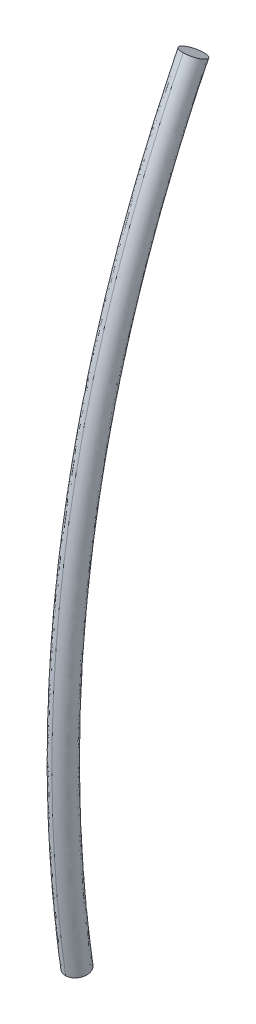
ISO-10303-21;
HEADER;
FILE_DESCRIPTION(('STEP AP214'),'2;1');
FILE_NAME('part.step','',(''),(''),'','','');
FILE_SCHEMA(('AUTOMOTIVE_DESIGN { 1 0 10303 214 1 1 1 1 }'));
ENDSEC;
DATA;
#1=APPLICATION_CONTEXT('core data for automotive mechanical design processes');
#2=APPLICATION_PROTOCOL_DEFINITION('international standard','automotive_design',2000,#1);
#3=PRODUCT_CONTEXT('',#1,'mechanical');
#4=PRODUCT('Part','Part','',(#3));
#5=PRODUCT_RELATED_PRODUCT_CATEGORY('part','',(#4));
#6=PRODUCT_DEFINITION_FORMATION('','',#4);
#7=PRODUCT_DEFINITION_CONTEXT('part definition',#1,'design');
#8=PRODUCT_DEFINITION('design','',#6,#7);
#9=PRODUCT_DEFINITION_SHAPE('','',#8);
#10=(LENGTH_UNIT() NAMED_UNIT(*) SI_UNIT(.MILLI.,.METRE.));
#11=(NAMED_UNIT(*) PLANE_ANGLE_UNIT() SI_UNIT($,.RADIAN.));
#12=(NAMED_UNIT(*) SI_UNIT($,.STERADIAN.) SOLID_ANGLE_UNIT());
#13=UNCERTAINTY_MEASURE_WITH_UNIT(LENGTH_MEASURE(1.E-05),#10,'distance_accuracy_value','');
#14=(GEOMETRIC_REPRESENTATION_CONTEXT(3) GLOBAL_UNCERTAINTY_ASSIGNED_CONTEXT((#13)) GLOBAL_UNIT_ASSIGNED_CONTEXT((#10,
#11,#12)) REPRESENTATION_CONTEXT('',''));
#15=CARTESIAN_POINT('',(0.,0.,0.));
#16=DIRECTION('',(0.,0.,1.));
#17=DIRECTION('',(1.,0.,0.));
#18=AXIS2_PLACEMENT_3D('',#15,#16,#17);
#19=CARTESIAN_POINT('',(-71.89158931535,31.2153070087,3.940002599999));
#20=DIRECTION('',(-4.4741601511132E-05,0.897114853412041,-0.44179739449852));
#21=DIRECTION('',(0.,0.441797394940718,0.897114854309968));
#22=AXIS2_PLACEMENT_3D('',#19,#20,#21);
#23=PLANE('',#22);
#24=CARTESIAN_POINT('',(-71.8915947739043,31.3257563571897,4.16428131363081));
#25=CARTESIAN_POINT('',(-71.9056589757299,31.3257609339028,4.16429203142194));
#26=CARTESIAN_POINT('',(-71.9197195857157,31.3252309427078,4.16321725396753));
#27=CARTESIAN_POINT('',(-71.9474330067474,31.3231407286132,4.1589756667796));
#28=CARTESIAN_POINT('',(-71.9610861086174,31.3215812597258,4.15581038817432));
#29=CARTESIAN_POINT('',(-71.9876117754916,31.3174699347401,4.14746460805658));
#30=CARTESIAN_POINT('',(-72.0004839751534,31.3149176182177,4.14228317156877));
#31=CARTESIAN_POINT('',(-72.0250736602609,31.3088953436464,4.13005681655938));
#32=CARTESIAN_POINT('',(-72.0367913719401,31.3054255658761,4.12301226413485));
#33=CARTESIAN_POINT('',(-72.0587355765952,31.2976685365329,4.10726304399484));
#34=CARTESIAN_POINT('',(-72.0689629638012,31.2933817787611,4.09855937908353));
#35=CARTESIAN_POINT('',(-72.0876582430892,31.2841045136755,4.07972283555885));
#36=CARTESIAN_POINT('',(-72.0961236477839,31.2791130279483,4.0695879699248));
#37=CARTESIAN_POINT('',(-72.1110258597953,31.2685800320856,4.04820115232887));
#38=CARTESIAN_POINT('',(-72.117465436727,31.2630392866302,4.03695075340858));
#39=CARTESIAN_POINT('',(-72.1281565340706,31.2515513203482,4.01362434411198));
#40=CARTESIAN_POINT('',(-72.132405093591,31.2456035617161,4.00154724136642));
#41=CARTESIAN_POINT('',(-72.1385781047119,31.2334814427592,3.97693266256617));
#42=CARTESIAN_POINT('',(-72.1405041185879,31.227307237639,3.96439550182825));
#43=CARTESIAN_POINT('',(-72.1419826178761,31.2149036999018,3.93920899795336));
#44=CARTESIAN_POINT('',(-72.1415351032342,31.2086743672836,3.92655965481384));
#45=CARTESIAN_POINT('',(-72.1382781082662,31.1963332277285,3.90149937726594));
#46=CARTESIAN_POINT('',(-72.1354670378366,31.1902215027453,3.88908860911196));
#47=CARTESIAN_POINT('',(-72.1275661397024,31.1783017204247,3.86488347028292));
#48=CARTESIAN_POINT('',(-72.1224793836466,31.172493265505,3.85308829258771));
#49=CARTESIAN_POINT('',(-72.1101635995681,31.1613281078515,3.83041504932206));
#50=CARTESIAN_POINT('',(-72.1029316392906,31.1559720364339,3.8195382654071));
#51=CARTESIAN_POINT('',(-72.086545177275,31.1458799808566,3.79904365355758));
#52=CARTESIAN_POINT('',(-72.0773933754947,31.1411431408714,3.78942408805493));
#53=CARTESIAN_POINT('',(-72.0574065334431,31.1324088333038,3.77168615796746));
#54=CARTESIAN_POINT('',(-72.0465691511143,31.1284124116986,3.76356991710902));
#55=CARTESIAN_POINT('',(-72.0235445301244,31.121285908719,3.74909649124935));
#56=CARTESIAN_POINT('',(-72.0113592069575,31.1181546195417,3.74273685387444));
#57=CARTESIAN_POINT('',(-71.9859543127793,31.1128354898313,3.73193324347405));
#58=CARTESIAN_POINT('',(-71.9727332478407,31.1106490428522,3.72749210005122));
#59=CARTESIAN_POINT('',(-71.945664138241,31.1072920798072,3.72067270146984));
#60=CARTESIAN_POINT('',(-71.931817085394,31.1061200120872,3.71829129561906));
#61=CARTESIAN_POINT('',(-71.9091255918094,31.1050601478743,3.71613683478779));
#62=CARTESIAN_POINT('',(-71.9003523890214,31.1048555735249,3.71572053714348));
#63=CARTESIAN_POINT('',(-71.8915838069301,31.1048576602118,3.71572388636519));
#64=B_SPLINE_CURVE_WITH_KNOTS('',3,(#24,#25,#26,#27,#28,#29,#30,#31,#32,#33,#34,#35,#36,#37,#38,
#39,#40,#41,#42,#43,#44,#45,#46,#47,#48,#49,#50,#51,#52,#53,#54,#55,#56,#57,#58,#59,#60,#61,#62,
#63),.UNSPECIFIED.,.F.,.F.,(4,2,2,2,2,2,2,2,2,2,2,2,2,2,2,2,2,2,2,4),(0.,0.0421365633234534,
0.084242299090836,0.126367584335775,0.16848459822216,0.210576235913576,0.252726897197846,
0.294819679125122,0.336969196202027,0.379090345285913,0.421211495328252,0.463361005447066,
0.505453794331361,0.54760438659307,0.589696093316827,0.631846816316597,0.673938392277649,
0.716091839232635,0.758180691249825,0.784486413896929),.UNSPECIFIED.);
#65=CARTESIAN_POINT('',(-71.8915947739043,31.3257563571915,4.1642813136308));
#66=VERTEX_POINT('',#65);
#67=CARTESIAN_POINT('',(-71.89158380693,31.1048576602107,3.71572388636629));
#68=VERTEX_POINT('',#67);
#69=EDGE_CURVE('E54',#66,#68,#64,.T.);
#70=ORIENTED_EDGE('',*,*,#69,.F.);
#71=CARTESIAN_POINT('',(-71.89158380693,31.1048576602122,3.71572388636605));
#72=CARTESIAN_POINT('',(-71.877519605102,31.1048530847383,3.71571317109116));
#73=CARTESIAN_POINT('',(-71.8634589953552,31.1053830771722,3.71678795106115));
#74=CARTESIAN_POINT('',(-71.8357455752664,31.1074732937084,3.72102954320731));
#75=CARTESIAN_POINT('',(-71.8220924741001,31.1090327637987,3.72419482425527));
#76=CARTESIAN_POINT('',(-71.7955668090811,31.1131440911214,3.73254060911876));
#77=CARTESIAN_POINT('',(-71.7826946105712,31.115696408778,3.73772204790957));
#78=CARTESIAN_POINT('',(-71.7581049281817,31.1217186855157,3.74994840731841));
#79=CARTESIAN_POINT('',(-71.7463872180685,31.1251884643183,3.75699296183941));
#80=CARTESIAN_POINT('',(-71.7244430169144,31.1329454955948,3.77274218590556));
#81=CARTESIAN_POINT('',(-71.7142156316434,31.1372322542677,3.78144585264667));
#82=CARTESIAN_POINT('',(-71.6955203565429,31.1465095210002,3.80028239951619));
#83=CARTESIAN_POINT('',(-71.6870549541013,31.1515010074732,3.81041726666482));
#84=CARTESIAN_POINT('',(-71.6721527468443,31.1620340046487,3.83180408692696));
#85=CARTESIAN_POINT('',(-71.6657131724136,31.1675747506713,3.84305448699936));
#86=CARTESIAN_POINT('',(-71.6550220802557,31.179062717895,3.86638089820871));
#87=CARTESIAN_POINT('',(-71.65077352342,31.1850104769014,3.87845800171437));
#88=CARTESIAN_POINT('',(-71.6446005177711,31.1971325964019,3.90307258161903));
#89=CARTESIAN_POINT('',(-71.6426745066821,31.2033068016916,3.91560974270155));
#90=CARTESIAN_POINT('',(-71.641196012993,31.2157103395588,3.94079624684095));
#91=CARTESIAN_POINT('',(-71.6416435304468,31.2219396721375,3.9534455899004));
#92=CARTESIAN_POINT('',(-71.6449005309859,31.2342808114052,3.97850586686529));
#93=CARTESIAN_POINT('',(-71.6477116041744,31.2403925361404,3.99091663451606));
#94=CARTESIAN_POINT('',(-71.6556125076896,31.2523123177643,4.01512177193096));
#95=CARTESIAN_POINT('',(-71.6606992663674,31.2581207722355,4.02691694871579));
#96=CARTESIAN_POINT('',(-71.673015055486,31.2692859288035,4.04959018977752));
#97=CARTESIAN_POINT('',(-71.6802470181813,31.2746419995837,4.06046697239843));
#98=CARTESIAN_POINT('',(-71.6966334847525,31.2847340537168,4.08096158131587));
#99=CARTESIAN_POINT('',(-71.705785288671,31.2894708928955,4.09058114518101));
#100=CARTESIAN_POINT('',(-71.7257721346659,31.2982051987024,4.10831907169361));
#101=CARTESIAN_POINT('',(-71.7366095187996,31.3022016193531,4.11643531061405));
#102=CARTESIAN_POINT('',(-71.7596341430088,31.3093281203044,4.13090873235538));
#103=CARTESIAN_POINT('',(-71.7718194675904,31.3124594084082,4.13726836755054));
#104=CARTESIAN_POINT('',(-71.7972243641927,31.3177785358854,4.14807197341646));
#105=CARTESIAN_POINT('',(-71.8104454301422,31.3199649817026,4.15251311448003));
#106=CARTESIAN_POINT('',(-71.8375145412784,31.3233219423608,4.15933250821503));
#107=CARTESIAN_POINT('',(-71.8513615946489,31.3244940088603,4.16171391158756));
#108=CARTESIAN_POINT('',(-71.8740530555945,31.3255538695226,4.16386836520545));
#109=CARTESIAN_POINT('',(-71.8828262250505,31.3257584430877,4.16428466125395));
#110=CARTESIAN_POINT('',(-71.8915947739041,31.3257563571901,4.16428131363168));
#111=B_SPLINE_CURVE_WITH_KNOTS('',3,(#71,#72,#73,#74,#75,#76,#77,#78,#79,#80,#81,#82,#83,#84,
#85,#86,#87,#88,#89,#90,#91,#92,#93,#94,#95,#96,#97,#98,#99,#100,#101,#102,#103,#104,#105,#106,
#107,#108,#109,#110),.UNSPECIFIED.,.F.,.F.,(4,2,2,2,2,2,2,2,2,2,2,2,2,2,2,2,2,2,2,4),(0.,
0.0421365633235624,0.0842422990910518,0.126367584336161,0.168484598222691,0.210576235914035,
0.252726897198208,0.29481967912527,0.336969196201963,0.379090345285659,0.421211495327791,
0.46336100544553,0.505453794328785,0.547604386589673,0.589696093312304,0.631846816316767,
0.673938392276203,0.716091839322575,0.758180691252607,0.784486314318599),.UNSPECIFIED.);
#112=EDGE_CURVE('E49',#68,#66,#111,.T.);
#113=ORIENTED_EDGE('',*,*,#112,.F.);
#114=EDGE_LOOP('',(#70,#113));
#115=FACE_BOUND('',#114,.T.);
#116=ADVANCED_FACE('F17',(#115),#23,.T.);
#117=CARTESIAN_POINT('',(-71.91054577577,15.01553524348,6.702501951935));
#118=CARTESIAN_POINT('',(-71.9105485357,15.07027838284,6.710712511291));
#119=CARTESIAN_POINT('',(-71.9106888601,17.87657677769,7.123739230423));
#120=CARTESIAN_POINT('',(-71.91096592176,23.44657360332,7.124204681072));
#121=CARTESIAN_POINT('',(-71.91123148213,28.75538243974,5.438146136849));
#122=CARTESIAN_POINT('',(-71.91136417435,31.42470415727,4.114511311997));
#123=CARTESIAN_POINT('',(-71.91136661499,31.47431315936,4.089742656795));
#124=CARTESIAN_POINT('',(-71.75522625823,15.01371601817,6.714683478726));
#125=CARTESIAN_POINT('',(-71.75522878562,15.0684814013,6.722897383545));
#126=CARTESIAN_POINT('',(-71.75536628666,17.8759232436,7.136092626776));
#127=CARTESIAN_POINT('',(-71.75564921044,23.44851247043,7.136581082709));
#128=CARTESIAN_POINT('',(-71.75590864351,28.75979170609,5.449712893822));
#129=CARTESIAN_POINT('',(-71.75604480215,31.43019412525,4.125541877702));
#130=CARTESIAN_POINT('',(-71.75604750702,31.47982315362,4.100763212281));
#131=CARTESIAN_POINT('',(-71.64078263258,15.02940326415,6.610125155409));
#132=CARTESIAN_POINT('',(-71.64078497829,15.08397772128,6.618310344952));
#133=CARTESIAN_POINT('',(-71.64091986748,17.88160495383,7.030059086643));
#134=CARTESIAN_POINT('',(-71.64120590567,23.43194268787,7.030350080141));
#135=CARTESIAN_POINT('',(-71.64145967563,28.722017622,5.350431355802));
#136=CARTESIAN_POINT('',(-71.6415978861,31.38314399785,4.030862657676));
#137=CARTESIAN_POINT('',(-71.64160077636,31.43260113355,4.00616991348));
#138=CARTESIAN_POINT('',(-71.6407837851,15.05251259961,6.456041205182));
#139=CARTESIAN_POINT('',(-71.64078611679,15.10680569575,6.464184078025));
#140=CARTESIAN_POINT('',(-71.64092028464,17.88996948047,6.873801160906));
#141=CARTESIAN_POINT('',(-71.64120468744,23.40751596683,6.873801160906));
#142=CARTESIAN_POINT('',(-71.64145689897,28.66634286185,5.204123619819));
#143=CARTESIAN_POINT('',(-71.6415944277,31.31379945675,3.891337197022));
#144=CARTESIAN_POINT('',(-71.64159730532,31.36300328024,3.866771071935));
#145=CARTESIAN_POINT('',(-71.64078493763,15.07562193508,6.301957254954));
#146=CARTESIAN_POINT('',(-71.64078725528,15.12963367022,6.310057811097));
#147=CARTESIAN_POINT('',(-71.64092070181,17.89833400711,6.717543235168));
#148=CARTESIAN_POINT('',(-71.64120346921,23.38308924579,6.717252241671));
#149=CARTESIAN_POINT('',(-71.64145412232,28.6106681017,5.057815883835));
#150=CARTESIAN_POINT('',(-71.64159096929,31.24445491565,3.751811736368));
#151=CARTESIAN_POINT('',(-71.64159383428,31.29340542693,3.727372230391));
#152=CARTESIAN_POINT('',(-71.75523012744,15.09129776574,6.197398931637));
#153=CARTESIAN_POINT('',(-71.75523260773,15.14511857485,6.205470772504));
#154=CARTESIAN_POINT('',(-71.75536768714,17.9040043018,6.611509695036));
#155=CARTESIAN_POINT('',(-71.75564512066,23.36650804809,6.611021239103));
#156=CARTESIAN_POINT('',(-71.75589932183,28.57288260203,4.958534345815));
#157=CARTESIAN_POINT('',(-71.75603319173,31.19739337292,3.657132516343));
#158=CARTESIAN_POINT('',(-71.75603585419,31.24617199155,3.63277893159));
#159=CARTESIAN_POINT('',(-71.91054946276,15.08946304801,6.209580458428));
#160=CARTESIAN_POINT('',(-71.91055217779,15.14330610087,6.217655644758));
#161=CARTESIAN_POINT('',(-71.91069019462,17.90333527498,6.623863091389));
#162=CARTESIAN_POINT('',(-71.91096202459,23.36843142305,6.62339764074));
#163=CARTESIAN_POINT('',(-71.91122259948,28.5772763756,4.970101102788));
#164=CARTESIAN_POINT('',(-71.91135311076,31.20286784846,3.668163082048));
#165=CARTESIAN_POINT('',(-71.91135551099,31.25166649339,3.643799487076));
#166=(BOUNDED_SURFACE() B_SPLINE_SURFACE(3,3,((#117,#118,#119,#120,#121,#122,#123),(#124,#125,
#126,#127,#128,#129,#130),(#131,#132,#133,#134,#135,#136,#137),(#138,#139,#140,#141,#142,#143,
#144),(#145,#146,#147,#148,#149,#150,#151),(#152,#153,#154,#155,#156,#157,#158),(#159,#160,#161,
#162,#163,#164,#165)),.UNSPECIFIED.,.F.,.F.,.F.) B_SPLINE_SURFACE_WITH_KNOTS((4,3,4),(4,1,1,1,
4),(0.,1.,2.),(-0.009704694177111,0.,0.4879969483221,1.,1.009700783096),
.UNSPECIFIED.) GEOMETRIC_REPRESENTATION_ITEM() RATIONAL_B_SPLINE_SURFACE(((1.191483109978,
1.191483109978,1.191483109978,1.191483109978,1.191483109978,1.191483109978,1.191483109978),
(0.9361722966739,0.9361722966739,0.9361722966739,0.9361722966739,0.9361722966739,
0.9361722966739,0.9361722966739),(0.9361722966739,0.9361722966739,0.9361722966739,
0.9361722966739,0.9361722966739,0.9361722966739,0.9361722966739),(1.191483109978,1.191483109978,
1.191483109978,1.191483109978,1.191483109978,1.191483109978,1.191483109978),(0.9361722966739,
0.9361722966739,0.9361722966739,0.9361722966739,0.9361722966739,0.9361722966739,
0.9361722966739),(0.9361722966739,0.9361722966739,0.9361722966739,0.9361722966739,
0.9361722966739,0.9361722966739,0.9361722966739),(1.191483109978,1.191483109978,1.191483109978,
1.191483109978,1.191483109978,1.191483109978,1.191483109978))) REPRESENTATION_ITEM('') SURFACE());
#167=CARTESIAN_POINT('',(-71.8907813821368,15.0154201703764,6.7032757863796));
#168=CARTESIAN_POINT('',(-71.890784112398,15.0701647227841,6.711486558257));
#169=CARTESIAN_POINT('',(-71.8909240738904,17.8765357554144,7.12452398292327));
#170=CARTESIAN_POINT('',(-71.8912018732701,23.4466972639437,7.12499089498849));
#171=CARTESIAN_POINT('',(-71.8914666460943,28.7556630330856,5.43888091789181));
#172=CARTESIAN_POINT('',(-71.8915997759755,31.4250534024411,4.11521203135942));
#173=CARTESIAN_POINT('',(-71.891602250183,31.4746636767075,4.09044274025583));
#174=(BOUNDED_CURVE() B_SPLINE_CURVE(3,(#167,#168,#169,#170,#171,#172,#173),.UNSPECIFIED.,.F.,
.F.) B_SPLINE_CURVE_WITH_KNOTS((4,1,1,1,4),(-0.009704694177111,0.,0.4879969483221,1.,
1.009700783096),
.UNSPECIFIED.) CURVE() GEOMETRIC_REPRESENTATION_ITEM() RATIONAL_B_SPLINE_CURVE((1.15305257544436,
1.15305257544436,1.15305257544436,1.15305257544436,1.15305257544436,1.15305257544436,1.15305257544436)) REPRESENTATION_ITEM(''));
#175=CARTESIAN_POINT('',(-71.8907895445433,15.179584598084,6.72743725390747));
#176=VERTEX_POINT('',#175);
#177=EDGE_CURVE('E46',#176,#66,#174,.T.);
#178=CARTESIAN_POINT('',(-71.8907895445433,15.1795845980831,6.72743725390785));
#179=CARTESIAN_POINT('',(-71.876725342892,15.1795835930078,6.72744907410684));
#180=CARTESIAN_POINT('',(-71.862664715405,15.1797554821316,6.72626332572785));
#181=CARTESIAN_POINT('',(-71.8349512253049,15.1804324525569,6.72158380228514));
#182=CARTESIAN_POINT('',(-71.8212980718928,15.1809372899995,6.71809171643288));
#183=CARTESIAN_POINT('',(-71.7947722691194,15.1822679044938,6.70888425780691));
#184=CARTESIAN_POINT('',(-71.7818999850854,15.1830938304475,6.70316785352525));
#185=CARTESIAN_POINT('',(-71.7573101008893,15.1850424344624,6.68967916570366));
#186=CARTESIAN_POINT('',(-71.7455922744997,15.1861650542241,6.68190728605886));
#187=CARTESIAN_POINT('',(-71.7236478133915,15.1886746374227,6.66453201121093));
#188=CARTESIAN_POINT('',(-71.7134202844592,15.1900614411806,6.65492972234753));
#189=CARTESIAN_POINT('',(-71.6947246984457,15.1930626016781,6.63414837045801));
#190=CARTESIAN_POINT('',(-71.6862591287197,15.1946772747801,6.6229671152595));
#191=CARTESIAN_POINT('',(-71.6713565684553,15.1980844458356,6.59937218414039));
#192=CARTESIAN_POINT('',(-71.6649168083274,15.1998766965635,6.58696022160631));
#193=CARTESIAN_POINT('',(-71.6542253311474,15.2035925896809,6.56122544442796));
#194=CARTESIAN_POINT('',(-71.649976574969,15.2055164059118,6.54790142463227));
#195=CARTESIAN_POINT('',(-71.6438031630357,15.2094372492238,6.52074548059349));
#196=CARTESIAN_POINT('',(-71.6418769450102,15.2114342261602,6.50691390422198));
#197=CARTESIAN_POINT('',(-71.6403980355965,15.2154459296282,6.47912698736858));
#198=CARTESIAN_POINT('',(-71.6408453442623,15.2174606561602,6.46517164688387));
#199=CARTESIAN_POINT('',(-71.6441019311604,15.2214520183084,6.43752399015703));
#200=CARTESIAN_POINT('',(-71.6469127994988,15.2234286273648,6.42383185733491));
#201=CARTESIAN_POINT('',(-71.6548133034878,15.2272835538181,6.3971276305839));
#202=CARTESIAN_POINT('',(-71.6598998674764,15.2291619999081,6.38411464631213));
#203=CARTESIAN_POINT('',(-71.6722152823542,15.232772710328,6.35910047893233));
#204=CARTESIAN_POINT('',(-71.679447065519,15.2345047703733,6.34710070980677));
#205=CARTESIAN_POINT('',(-71.6958331938095,15.2377682718231,6.32449011061242));
#206=CARTESIAN_POINT('',(-71.704984838949,15.2392999901169,6.3138773635773));
#207=CARTESIAN_POINT('',(-71.7249713921644,15.2421242359725,6.29430806431526));
#208=CARTESIAN_POINT('',(-71.7358086423324,15.2434164251567,6.28535385508242));
#209=CARTESIAN_POINT('',(-71.758833027645,15.2457205590839,6.26938610882755));
#210=CARTESIAN_POINT('',(-71.771018247255,15.2467328945292,6.26236986623264));
#211=CARTESIAN_POINT('',(-71.7964229655288,15.2484523926098,6.25045083088583));
#212=CARTESIAN_POINT('',(-71.8096439581673,15.2491591044795,6.24555115988646));
#213=CARTESIAN_POINT('',(-71.8367129567381,15.2502439263579,6.23802769186609));
#214=CARTESIAN_POINT('',(-71.8505599708027,15.2506225382498,6.23540041884816));
#215=CARTESIAN_POINT('',(-71.8732514044679,15.2509645611797,6.23302352730336));
#216=CARTESIAN_POINT('',(-71.8820245754101,15.2510304298804,6.23256425109995));
#217=CARTESIAN_POINT('',(-71.8907931326297,15.251029459118,6.23256794609118));
#218=B_SPLINE_CURVE_WITH_KNOTS('',3,(#178,#179,#180,#181,#182,#183,#184,#185,#186,#187,#188,
#189,#190,#191,#192,#193,#194,#195,#196,#197,#198,#199,#200,#201,#202,#203,#204,#205,#206,#207,
#208,#209,#210,#211,#212,#213,#214,#215,#216,#217),.UNSPECIFIED.,.F.,.F.,(4,2,2,2,2,2,2,2,2,2,2,
2,2,2,2,2,2,2,2,4),(0.,0.0421365633239248,0.0842422990918048,0.126367584337263,
0.168484598224176,0.21057623591536,0.252726897199417,0.294819679126429,0.336969196203091,
0.379090345287101,0.421211495329541,0.463361005447745,0.505453794331458,0.547604386592338,
0.589696093315029,0.631846816317693,0.673938392276928,0.716091839299673,0.758180691250769,
0.784486339216353),.UNSPECIFIED.);
#219=CARTESIAN_POINT('',(-71.8907931326298,15.251029459118,6.23256794609135));
#220=VERTEX_POINT('',#219);
#221=EDGE_CURVE('E37',#176,#220,#218,.T.);
#222=CARTESIAN_POINT('',(-71.890785080695,15.0895800925241,6.2088066239834));
#223=CARTESIAN_POINT('',(-71.8907877659339,15.1434217323427,6.216881597792));
#224=CARTESIAN_POINT('',(-71.8909254126016,17.9033782686978,6.62307833888874));
#225=CARTESIAN_POINT('',(-71.8911979638649,23.3683097337999,6.62261142682351));
#226=CARTESIAN_POINT('',(-71.8914577355559,28.576997753699,4.96936632174519));
#227=CARTESIAN_POINT('',(-71.89158867765,31.2025205746968,3.66746236268557));
#228=CARTESIAN_POINT('',(-71.8915911113104,31.251317947453,3.64309940361517));
#229=B_SPLINE_CURVE_WITH_KNOTS('',3,(#222,#223,#224,#225,#226,#227,#228),.UNSPECIFIED.,.F.,.F.,
(4,1,1,1,4),(-0.009704694177111,0.,0.4879969483221,1.,1.009700783096),.UNSPECIFIED.);
#230=EDGE_CURVE('E30',#68,#220,#229,.F.);
#231=ORIENTED_EDGE('',*,*,#177,.F.);
#232=ORIENTED_EDGE('',*,*,#221,.T.);
#233=ORIENTED_EDGE('',*,*,#230,.F.);
#234=ORIENTED_EDGE('',*,*,#112,.T.);
#235=EDGE_LOOP('',(#231,#232,#233,#234));
#236=FACE_BOUND('',#235,.T.);
#237=ADVANCED_FACE('F48',(#236),#166,.T.);
#238=CARTESIAN_POINT('',(-71.89079135105,15.2153070286,6.480002599999));
#239=DIRECTION('',(-4.93610049092013E-05,0.989738614402225,0.142889722249904));
#240=DIRECTION('',(0.,-0.14288972242398,0.989738615607979));
#241=AXIS2_PLACEMENT_3D('',#238,#239,#240);
#242=PLANE('',#241);
#243=ORIENTED_EDGE('',*,*,#221,.F.);
#244=CARTESIAN_POINT('',(-71.8907931326298,15.2510294591179,6.23256794609151));
#245=CARTESIAN_POINT('',(-71.904857334279,15.2510304643936,6.23255612450426));
#246=CARTESIAN_POINT('',(-71.9189179618846,15.2508585754702,6.23374187149531));
#247=CARTESIAN_POINT('',(-71.9466314524543,15.2501816054399,6.23842139220224));
#248=CARTESIAN_POINT('',(-71.9602846062173,15.2496767681919,6.24191347670665));
#249=CARTESIAN_POINT('',(-71.9868104099166,15.2483461540756,6.25112093271374));
#250=CARTESIAN_POINT('',(-71.9996826945258,15.2475202283054,6.25683733572441));
#251=CARTESIAN_POINT('',(-72.0242725800794,15.245571624641,6.27032602111781));
#252=CARTESIAN_POINT('',(-72.0359904072513,15.2444490050463,6.27809789960537));
#253=CARTESIAN_POINT('',(-72.0579348701094,15.2419394221605,6.2954731722861));
#254=CARTESIAN_POINT('',(-72.068162400009,15.2405526185484,6.30507546013951));
#255=CARTESIAN_POINT('',(-72.0868579881161,15.2375514583174,6.32585681018262));
#256=CARTESIAN_POINT('',(-72.0953235589687,15.2359367853359,6.33703806454498));
#257=CARTESIAN_POINT('',(-72.1102261216108,15.2325296144928,6.36063299419229));
#258=CARTESIAN_POINT('',(-72.1166658829897,15.2307373638567,6.37304495609047));
#259=CARTESIAN_POINT('',(-72.1273573627633,15.2270214708916,6.39877973221307));
#260=CARTESIAN_POINT('',(-72.1316061202846,15.2250976547212,6.41210375158918));
#261=CARTESIAN_POINT('',(-72.1377795349551,15.221176811497,6.43925969501851));
#262=CARTESIAN_POINT('',(-72.1397057543746,15.219179834588,6.4530912712));
#263=CARTESIAN_POINT('',(-72.141184666589,15.2151681311409,6.48087818790769));
#264=CARTESIAN_POINT('',(-72.1407373593299,15.2131534046024,6.49483352843672));
#265=CARTESIAN_POINT('',(-72.1374807752185,15.2091620424076,6.52248118548552));
#266=CARTESIAN_POINT('',(-72.1346699082601,15.207185433311,6.53617331858544));
#267=CARTESIAN_POINT('',(-72.1267694069623,15.2033305067449,6.562877546117));
#268=CARTESIAN_POINT('',(-72.1216828442852,15.2014520605823,6.57589053089123));
#269=CARTESIAN_POINT('',(-72.1093674319283,15.1978413499868,6.60090469948704));
#270=CARTESIAN_POINT('',(-72.1021356499729,15.1961092898383,6.61290446932649));
#271=CARTESIAN_POINT('',(-72.0857495239613,15.1928457881548,6.63551507013846));
#272=CARTESIAN_POINT('',(-72.0765978798915,15.1913140697306,6.64612781807705));
#273=CARTESIAN_POINT('',(-72.0566113286487,15.1884898235901,6.66569711931192));
#274=CARTESIAN_POINT('',(-72.0457740793833,15.1871976342514,6.67465132961442));
#275=CARTESIAN_POINT('',(-72.0227496956809,15.184893499996,6.69061907814233));
#276=CARTESIAN_POINT('',(-72.0105644767783,15.1838811643769,6.69763532194029));
#277=CARTESIAN_POINT('',(-71.9851597597167,15.1821616659349,6.70955435978976));
#278=CARTESIAN_POINT('',(-71.9719387675836,15.1814549538772,6.71445403209123));
#279=CARTESIAN_POINT('',(-71.9448697697809,15.1803701316126,6.72197750278619));
#280=CARTESIAN_POINT('',(-71.9310227559778,15.1799915195233,6.72460477717174));
#281=CARTESIAN_POINT('',(-71.908331305992,15.1796494960196,6.72698167269643));
#282=CARTESIAN_POINT('',(-71.8995581183828,15.1795836271926,6.72744094978035));
#283=CARTESIAN_POINT('',(-71.8907895445434,15.1795845980832,6.72743725390695));
#284=B_SPLINE_CURVE_WITH_KNOTS('',3,(#244,#245,#246,#247,#248,#249,#250,#251,#252,#253,#254,
#255,#256,#257,#258,#259,#260,#261,#262,#263,#264,#265,#266,#267,#268,#269,#270,#271,#272,#273,
#274,#275,#276,#277,#278,#279,#280,#281,#282,#283),.UNSPECIFIED.,.F.,.F.,(4,2,2,2,2,2,2,2,2,2,2,
2,2,2,2,2,2,2,2,4),(0.,0.0421365633211036,0.0842422990860849,0.126367584328597,0.16848459821258,
0.210576235902258,0.252726897184783,0.294819679111542,0.336969196187947,0.379090345272467,
0.421211495315406,0.463361005434468,0.505453794319042,0.547604386579631,0.589696093302182,
0.631846816303164,0.673938392263849,0.716091839241838,0.758180691237336,0.784486388996394),.UNSPECIFIED.);
#285=EDGE_CURVE('E11',#220,#176,#284,.T.);
#286=ORIENTED_EDGE('',*,*,#285,.F.);
#287=EDGE_LOOP('',(#243,#286));
#288=FACE_BOUND('',#287,.T.);
#289=ADVANCED_FACE('F58',(#288),#242,.F.);
#290=CARTESIAN_POINT('',(-71.87102068706,15.08946501942,6.209580458428));
#291=CARTESIAN_POINT('',(-71.87102334264,15.14330807228,6.217655644758));
#292=CARTESIAN_POINT('',(-71.8711606264,17.90333724642,6.623863091389));
#293=CARTESIAN_POINT('',(-71.87143391538,23.36843339442,6.62339764074));
#294=CARTESIAN_POINT('',(-71.87169289952,28.57727834705,4.970101102788));
#295=CARTESIAN_POINT('',(-71.87182427928,31.20286981987,3.668163082048));
#296=CARTESIAN_POINT('',(-71.8718267465,31.2516684648,3.643799487076));
#297=CARTESIAN_POINT('',(-72.02634020461,15.09128424473,6.197398931637));
#298=CARTESIAN_POINT('',(-72.02634309271,15.14510505382,6.205470772504));
#299=CARTESIAN_POINT('',(-72.02648319984,17.90399078052,6.611509695036));
#300=CARTESIAN_POINT('',(-72.02675062669,23.36649452731,6.611021239103));
#301=CARTESIAN_POINT('',(-72.02701573814,28.5728690807,4.958534345815));
#302=CARTESIAN_POINT('',(-72.02714365149,31.19737985189,3.657132516343));
#303=CARTESIAN_POINT('',(-72.02714585448,31.24615847054,3.63277893159));
#304=CARTESIAN_POINT('',(-72.14078383026,15.07559699875,6.301957254954));
#305=CARTESIAN_POINT('',(-72.14078690004,15.12960873385,6.310057811097));
#306=CARTESIAN_POINT('',(-72.14092961902,17.89830907028,6.717543235168));
#307=CARTESIAN_POINT('',(-72.14119393147,23.38306430988,6.717252241671));
#308=CARTESIAN_POINT('',(-72.14146470602,28.61064316479,5.057815883835));
#309=CARTESIAN_POINT('',(-72.14159056753,31.24442997929,3.751811736368));
#310=CARTESIAN_POINT('',(-72.14159258513,31.29338049061,3.727372230391));
#311=CARTESIAN_POINT('',(-72.14078267773,15.05248766329,6.456041205181));
#312=CARTESIAN_POINT('',(-72.14078576154,15.10678075938,6.464184078025));
#313=CARTESIAN_POINT('',(-72.14092920185,17.88994454364,6.873801160906));
#314=CARTESIAN_POINT('',(-72.1411951497,23.40749103092,6.873801160906));
#315=CARTESIAN_POINT('',(-72.14146748268,28.66631792494,5.204123619819));
#316=CARTESIAN_POINT('',(-72.14159402593,31.31377452039,3.891337197022));
#317=CARTESIAN_POINT('',(-72.14159605617,31.36297834392,3.866771071935));
#318=CARTESIAN_POINT('',(-72.14078152521,15.02937832782,6.610125155409));
#319=CARTESIAN_POINT('',(-72.14078462305,15.08395278491,6.618310344952));
#320=CARTESIAN_POINT('',(-72.14092878469,17.88158001701,7.030059086644));
#321=CARTESIAN_POINT('',(-72.14119636793,23.43191775196,7.030350080141));
#322=CARTESIAN_POINT('',(-72.14147025933,28.72199268508,5.350431355802));
#323=CARTESIAN_POINT('',(-72.14159748434,31.38311906149,4.030862657676));
#324=CARTESIAN_POINT('',(-72.14159952721,31.43257619723,4.00616991348));
#325=CARTESIAN_POINT('',(-72.02633633539,15.01370249716,6.714683478726));
#326=CARTESIAN_POINT('',(-72.0263392706,15.06846788027,6.722897383545));
#327=CARTESIAN_POINT('',(-72.02648179936,17.87590972232,7.136092626776));
#328=CARTESIAN_POINT('',(-72.02675471648,23.44849894965,7.136581082709));
#329=CARTESIAN_POINT('',(-72.02702505982,28.75977818476,5.449712893822));
#330=CARTESIAN_POINT('',(-72.0271552619,31.43018060422,4.125541877702));
#331=CARTESIAN_POINT('',(-72.02715750731,31.47980963261,4.100763212281));
#332=CARTESIAN_POINT('',(-71.87101700008,15.01553721489,6.702501951935));
#333=CARTESIAN_POINT('',(-71.87101970054,15.07028035426,6.710712511291));
#334=CARTESIAN_POINT('',(-71.87115929188,17.87657874914,7.123739230423));
#335=CARTESIAN_POINT('',(-71.87143781255,23.4465755747,7.124204681072));
#336=CARTESIAN_POINT('',(-71.87170178217,28.75538441119,5.438146136849));
#337=CARTESIAN_POINT('',(-71.87183534287,31.42470612868,4.114511311997));
#338=CARTESIAN_POINT('',(-71.87183785051,31.47431513077,4.089742656795));
#339=(BOUNDED_SURFACE() B_SPLINE_SURFACE(3,3,((#290,#291,#292,#293,#294,#295,#296),(#297,#298,
#299,#300,#301,#302,#303),(#304,#305,#306,#307,#308,#309,#310),(#311,#312,#313,#314,#315,#316,
#317),(#318,#319,#320,#321,#322,#323,#324),(#325,#326,#327,#328,#329,#330,#331),(#332,#333,#334,
#335,#336,#337,#338)),.UNSPECIFIED.,.F.,.F.,.F.) B_SPLINE_SURFACE_WITH_KNOTS((4,3,4),(4,1,1,1,
4),(0.,1.,2.),(-0.009704694177111,0.,0.4879969483221,1.,1.009700783096),
.UNSPECIFIED.) GEOMETRIC_REPRESENTATION_ITEM() RATIONAL_B_SPLINE_SURFACE(((1.191483109978,
1.191483109978,1.191483109978,1.191483109978,1.191483109978,1.191483109978,1.191483109978),
(0.9361722966739,0.9361722966739,0.9361722966739,0.9361722966739,0.9361722966739,
0.9361722966739,0.9361722966739),(0.9361722966739,0.9361722966739,0.9361722966739,
0.9361722966739,0.9361722966739,0.9361722966739,0.9361722966739),(1.191483109978,1.191483109978,
1.191483109978,1.191483109978,1.191483109978,1.191483109978,1.191483109978),(0.9361722966739,
0.9361722966739,0.9361722966739,0.9361722966739,0.9361722966739,0.9361722966739,
0.9361722966739),(0.9361722966739,0.9361722966739,0.9361722966739,0.9361722966739,
0.9361722966739,0.9361722966739,0.9361722966739),(1.191483109978,1.191483109978,1.191483109978,
1.191483109978,1.191483109978,1.191483109978,1.191483109978))) REPRESENTATION_ITEM('') SURFACE());
#340=ORIENTED_EDGE('',*,*,#230,.T.);
#341=ORIENTED_EDGE('',*,*,#285,.T.);
#342=ORIENTED_EDGE('',*,*,#177,.T.);
#343=ORIENTED_EDGE('',*,*,#69,.T.);
#344=EDGE_LOOP('',(#340,#341,#342,#343));
#345=FACE_BOUND('',#344,.T.);
#346=ADVANCED_FACE('F61',(#345),#339,.T.);
#347=CLOSED_SHELL('',(#116,#237,#289,#346));
#348=MANIFOLD_SOLID_BREP('B1',#347);
#349=ADVANCED_BREP_SHAPE_REPRESENTATION('',(#18,#348),#14);
#350=SHAPE_DEFINITION_REPRESENTATION(#9,#349);
ENDSEC;
END-ISO-10303-21;
